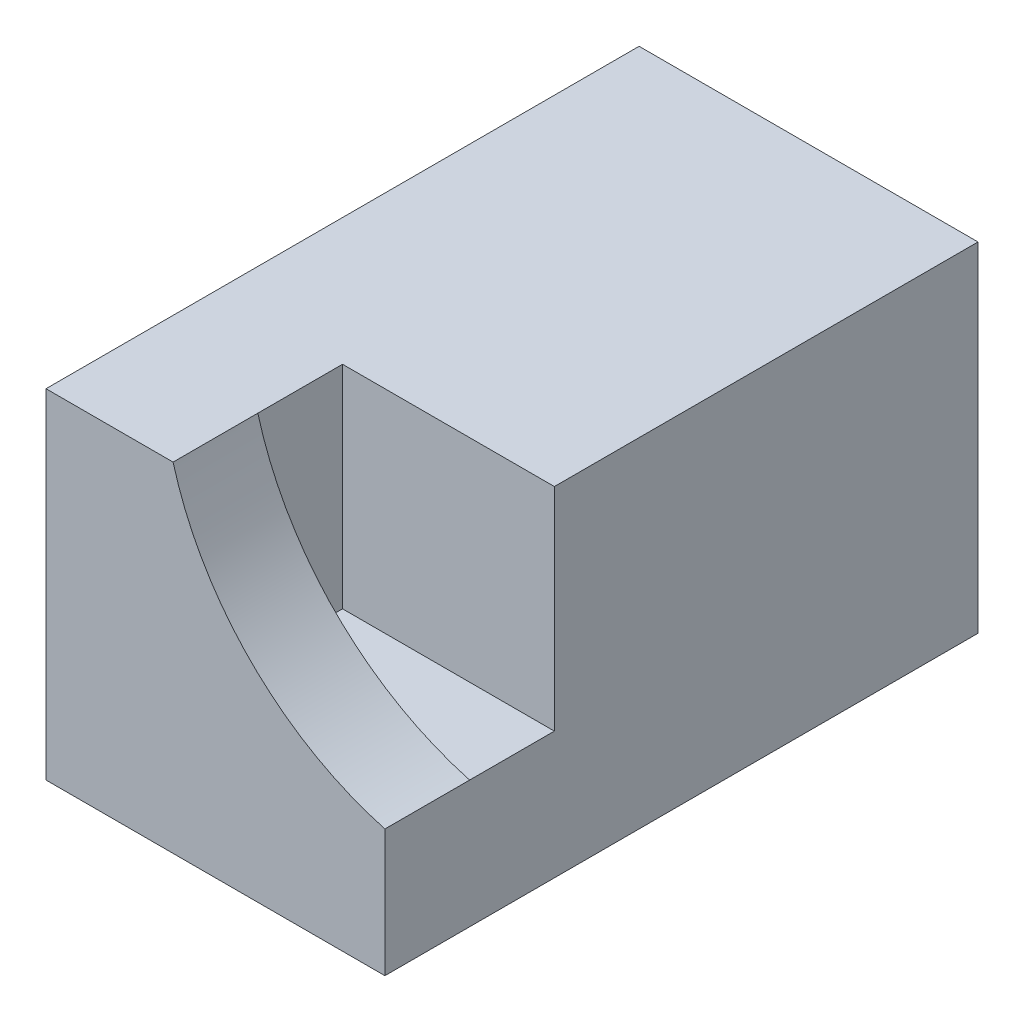
ISO-10303-21;
HEADER;
FILE_DESCRIPTION(('STEP AP214'),'2;1');
FILE_NAME('part.step','',(''),(''),'','','');
FILE_SCHEMA(('AUTOMOTIVE_DESIGN { 1 0 10303 214 1 1 1 1 }'));
ENDSEC;
DATA;
#1=APPLICATION_CONTEXT('core data for automotive mechanical design processes');
#2=APPLICATION_PROTOCOL_DEFINITION('international standard','automotive_design',2000,#1);
#3=PRODUCT_CONTEXT('',#1,'mechanical');
#4=PRODUCT('Part','Part','',(#3));
#5=PRODUCT_RELATED_PRODUCT_CATEGORY('part','',(#4));
#6=PRODUCT_DEFINITION_FORMATION('','',#4);
#7=PRODUCT_DEFINITION_CONTEXT('part definition',#1,'design');
#8=PRODUCT_DEFINITION('design','',#6,#7);
#9=PRODUCT_DEFINITION_SHAPE('','',#8);
#10=(LENGTH_UNIT() NAMED_UNIT(*) SI_UNIT(.MILLI.,.METRE.));
#11=(NAMED_UNIT(*) PLANE_ANGLE_UNIT() SI_UNIT($,.RADIAN.));
#12=(NAMED_UNIT(*) SI_UNIT($,.STERADIAN.) SOLID_ANGLE_UNIT());
#13=UNCERTAINTY_MEASURE_WITH_UNIT(LENGTH_MEASURE(1.E-05),#10,'distance_accuracy_value','');
#14=(GEOMETRIC_REPRESENTATION_CONTEXT(3) GLOBAL_UNCERTAINTY_ASSIGNED_CONTEXT((#13)) GLOBAL_UNIT_ASSIGNED_CONTEXT((#10,
#11,#12)) REPRESENTATION_CONTEXT('',''));
#15=CARTESIAN_POINT('',(0.,0.,0.));
#16=DIRECTION('',(0.,0.,1.));
#17=DIRECTION('',(1.,0.,0.));
#18=AXIS2_PLACEMENT_3D('',#15,#16,#17);
#19=CARTESIAN_POINT('',(0.,0.,14.));
#20=DIRECTION('',(1.,0.,0.));
#21=DIRECTION('',(0.,0.,-1.));
#22=AXIS2_PLACEMENT_3D('',#19,#20,#21);
#23=PLANE('',#22);
#24=DIRECTION('',(0.,-1.,0.));
#25=VECTOR('',#24,1.);
#26=CARTESIAN_POINT('',(0.,0.,0.));
#27=LINE('',#26,#25);
#28=CARTESIAN_POINT('',(0.,8.,0.));
#29=VERTEX_POINT('',#28);
#30=CARTESIAN_POINT('',(0.,0.,0.));
#31=VERTEX_POINT('',#30);
#32=EDGE_CURVE('E151',#29,#31,#27,.T.);
#33=ORIENTED_EDGE('',*,*,#32,.T.);
#34=DIRECTION('',(0.,0.,-1.));
#35=VECTOR('',#34,1.);
#36=CARTESIAN_POINT('',(0.,0.,14.));
#37=LINE('',#36,#35);
#38=CARTESIAN_POINT('',(0.,0.,14.));
#39=VERTEX_POINT('',#38);
#40=EDGE_CURVE('E44',#39,#31,#37,.T.);
#41=ORIENTED_EDGE('',*,*,#40,.F.);
#42=DIRECTION('',(0.,-1.,0.));
#43=VECTOR('',#42,1.);
#44=CARTESIAN_POINT('',(0.,0.,14.));
#45=LINE('',#44,#43);
#46=CARTESIAN_POINT('',(0.,8.,14.));
#47=VERTEX_POINT('',#46);
#48=EDGE_CURVE('E154',#47,#39,#45,.T.);
#49=ORIENTED_EDGE('',*,*,#48,.F.);
#50=DIRECTION('',(0.,0.,-1.));
#51=VECTOR('',#50,1.);
#52=CARTESIAN_POINT('',(0.,8.,14.));
#53=LINE('',#52,#51);
#54=EDGE_CURVE('E161',#47,#29,#53,.T.);
#55=ORIENTED_EDGE('',*,*,#54,.T.);
#56=EDGE_LOOP('',(#33,#41,#49,#55));
#57=FACE_BOUND('',#56,.T.);
#58=ADVANCED_FACE('F37',(#57),#23,.F.);
#59=CARTESIAN_POINT('',(0.,0.,14.));
#60=DIRECTION('',(0.,1.,0.));
#61=DIRECTION('',(0.,0.,1.));
#62=AXIS2_PLACEMENT_3D('',#59,#60,#61);
#63=PLANE('',#62);
#64=DIRECTION('',(1.,0.,0.));
#65=VECTOR('',#64,1.);
#66=CARTESIAN_POINT('',(0.,0.,0.));
#67=LINE('',#66,#65);
#68=CARTESIAN_POINT('',(8.,0.,0.));
#69=VERTEX_POINT('',#68);
#70=EDGE_CURVE('E164',#31,#69,#67,.T.);
#71=ORIENTED_EDGE('',*,*,#70,.T.);
#72=DIRECTION('',(0.,0.,-1.));
#73=VECTOR('',#72,1.);
#74=CARTESIAN_POINT('',(8.,0.,14.));
#75=LINE('',#74,#73);
#76=CARTESIAN_POINT('',(8.,0.,14.));
#77=VERTEX_POINT('',#76);
#78=EDGE_CURVE('E173',#77,#69,#75,.T.);
#79=ORIENTED_EDGE('',*,*,#78,.F.);
#80=DIRECTION('',(1.,0.,0.));
#81=VECTOR('',#80,1.);
#82=CARTESIAN_POINT('',(0.,0.,14.));
#83=LINE('',#82,#81);
#84=EDGE_CURVE('E84',#39,#77,#83,.T.);
#85=ORIENTED_EDGE('',*,*,#84,.F.);
#86=ORIENTED_EDGE('',*,*,#40,.T.);
#87=EDGE_LOOP('',(#71,#79,#85,#86));
#88=FACE_BOUND('',#87,.T.);
#89=ADVANCED_FACE('F176',(#88),#63,.F.);
#90=CARTESIAN_POINT('',(8.,0.,14.));
#91=DIRECTION('',(-1.,0.,0.));
#92=DIRECTION('',(0.,0.,1.));
#93=AXIS2_PLACEMENT_3D('',#90,#91,#92);
#94=PLANE('',#93);
#95=DIRECTION('',(0.,1.,0.));
#96=VECTOR('',#95,1.);
#97=CARTESIAN_POINT('',(8.,0.,10.));
#98=LINE('',#97,#96);
#99=CARTESIAN_POINT('',(8.,3.,10.));
#100=VERTEX_POINT('',#99);
#101=CARTESIAN_POINT('',(8.,8.,10.));
#102=VERTEX_POINT('',#101);
#103=EDGE_CURVE('E139',#100,#102,#98,.T.);
#104=ORIENTED_EDGE('',*,*,#103,.F.);
#105=DIRECTION('',(0.,0.,1.));
#106=VECTOR('',#105,1.);
#107=CARTESIAN_POINT('',(8.,3.,10.));
#108=LINE('',#107,#106);
#109=CARTESIAN_POINT('',(8.,3.,12.));
#110=VERTEX_POINT('',#109);
#111=EDGE_CURVE('E142',#100,#110,#108,.T.);
#112=ORIENTED_EDGE('',*,*,#111,.T.);
#113=CARTESIAN_POINT('',(8.,3.,14.));
#114=VERTEX_POINT('',#113);
#115=EDGE_CURVE('E146',#110,#114,#108,.T.);
#116=ORIENTED_EDGE('',*,*,#115,.T.);
#117=DIRECTION('',(0.,1.,0.));
#118=VECTOR('',#117,1.);
#119=CARTESIAN_POINT('',(8.,0.,14.));
#120=LINE('',#119,#118);
#121=EDGE_CURVE('E157',#77,#114,#120,.T.);
#122=ORIENTED_EDGE('',*,*,#121,.F.);
#123=ORIENTED_EDGE('',*,*,#78,.T.);
#124=DIRECTION('',(0.,1.,0.));
#125=VECTOR('',#124,1.);
#126=CARTESIAN_POINT('',(8.,0.,0.));
#127=LINE('',#126,#125);
#128=CARTESIAN_POINT('',(8.,8.,0.));
#129=VERTEX_POINT('',#128);
#130=EDGE_CURVE('E166',#69,#129,#127,.T.);
#131=ORIENTED_EDGE('',*,*,#130,.T.);
#132=DIRECTION('',(0.,0.,-1.));
#133=VECTOR('',#132,1.);
#134=CARTESIAN_POINT('',(8.,8.,14.));
#135=LINE('',#134,#133);
#136=EDGE_CURVE('E171',#102,#129,#135,.T.);
#137=ORIENTED_EDGE('',*,*,#136,.F.);
#138=EDGE_LOOP('',(#104,#112,#116,#122,#123,#131,#137));
#139=FACE_BOUND('',#138,.T.);
#140=ADVANCED_FACE('F186',(#139),#94,.F.);
#141=CARTESIAN_POINT('',(0.,8.,14.));
#142=DIRECTION('',(0.,-1.,0.));
#143=DIRECTION('',(0.,0.,-1.));
#144=AXIS2_PLACEMENT_3D('',#141,#142,#143);
#145=PLANE('',#144);
#146=DIRECTION('',(-1.,0.,0.));
#147=VECTOR('',#146,1.);
#148=CARTESIAN_POINT('',(0.,8.,14.));
#149=LINE('',#148,#147);
#150=CARTESIAN_POINT('',(3.,8.,14.));
#151=VERTEX_POINT('',#150);
#152=EDGE_CURVE('E58',#151,#47,#149,.T.);
#153=ORIENTED_EDGE('',*,*,#152,.F.);
#154=DIRECTION('',(0.,0.,1.));
#155=VECTOR('',#154,1.);
#156=CARTESIAN_POINT('',(3.,8.,10.));
#157=LINE('',#156,#155);
#158=CARTESIAN_POINT('',(3.,8.,12.));
#159=VERTEX_POINT('',#158);
#160=EDGE_CURVE('E50',#159,#151,#157,.T.);
#161=ORIENTED_EDGE('',*,*,#160,.F.);
#162=CARTESIAN_POINT('',(3.,8.,10.));
#163=VERTEX_POINT('',#162);
#164=EDGE_CURVE('E118',#163,#159,#157,.T.);
#165=ORIENTED_EDGE('',*,*,#164,.F.);
#166=DIRECTION('',(-1.,0.,0.));
#167=VECTOR('',#166,1.);
#168=CARTESIAN_POINT('',(0.,8.,10.));
#169=LINE('',#168,#167);
#170=EDGE_CURVE('E136',#102,#163,#169,.T.);
#171=ORIENTED_EDGE('',*,*,#170,.F.);
#172=ORIENTED_EDGE('',*,*,#136,.T.);
#173=DIRECTION('',(-1.,0.,0.));
#174=VECTOR('',#173,1.);
#175=CARTESIAN_POINT('',(0.,8.,0.));
#176=LINE('',#175,#174);
#177=EDGE_CURVE('E78',#129,#29,#176,.T.);
#178=ORIENTED_EDGE('',*,*,#177,.T.);
#179=ORIENTED_EDGE('',*,*,#54,.F.);
#180=EDGE_LOOP('',(#153,#161,#165,#171,#172,#178,#179));
#181=FACE_BOUND('',#180,.T.);
#182=ADVANCED_FACE('F189',(#181),#145,.F.);
#183=CARTESIAN_POINT('',(0.,0.,14.));
#184=DIRECTION('',(0.,0.,-1.));
#185=DIRECTION('',(-1.,0.,0.));
#186=AXIS2_PLACEMENT_3D('',#183,#184,#185);
#187=PLANE('',#186);
#188=ORIENTED_EDGE('',*,*,#121,.T.);
#189=CARTESIAN_POINT('',(9.89778880751547,9.89778880751547,14.));
#190=DIRECTION('',(0.,0.,1.));
#191=DIRECTION('',(1.,0.,0.));
#192=AXIS2_PLACEMENT_3D('',#189,#190,#191);
#193=CIRCLE('',#192,7.15409622461263);
#194=EDGE_CURVE('E134',#151,#114,#193,.T.);
#195=ORIENTED_EDGE('',*,*,#194,.F.);
#196=ORIENTED_EDGE('',*,*,#152,.T.);
#197=ORIENTED_EDGE('',*,*,#48,.T.);
#198=ORIENTED_EDGE('',*,*,#84,.T.);
#199=EDGE_LOOP('',(#188,#195,#196,#197,#198));
#200=FACE_BOUND('',#199,.T.);
#201=ADVANCED_FACE('F188',(#200),#187,.F.);
#202=CARTESIAN_POINT('',(0.,0.,0.));
#203=DIRECTION('',(0.,0.,-1.));
#204=DIRECTION('',(-1.,0.,0.));
#205=AXIS2_PLACEMENT_3D('',#202,#203,#204);
#206=PLANE('',#205);
#207=CARTESIAN_POINT('',(4.,4.,0.));
#208=DIRECTION('',(0.,0.,-1.));
#209=DIRECTION('',(-1.,0.,0.));
#210=AXIS2_PLACEMENT_3D('',#207,#208,#209);
#211=CIRCLE('',#210,1.375);
#212=CARTESIAN_POINT('',(2.625,4.,0.));
#213=VERTEX_POINT('',#212);
#214=EDGE_CURVE('E145',#213,#213,#211,.T.);
#215=ORIENTED_EDGE('',*,*,#214,.F.);
#216=EDGE_LOOP('',(#215));
#217=FACE_BOUND('',#216,.T.);
#218=ORIENTED_EDGE('',*,*,#32,.F.);
#219=ORIENTED_EDGE('',*,*,#177,.F.);
#220=ORIENTED_EDGE('',*,*,#130,.F.);
#221=ORIENTED_EDGE('',*,*,#70,.F.);
#222=EDGE_LOOP('',(#218,#219,#220,#221));
#223=FACE_BOUND('',#222,.T.);
#224=ADVANCED_FACE('F181',(#217,#223),#206,.T.);
#225=CARTESIAN_POINT('',(4.,4.,8.));
#226=DIRECTION('',(0.,0.,-1.));
#227=DIRECTION('',(-1.,0.,0.));
#228=AXIS2_PLACEMENT_3D('',#225,#226,#227);
#229=CYLINDRICAL_SURFACE('',#228,1.375);
#230=CARTESIAN_POINT('',(4.,4.,8.));
#231=DIRECTION('',(0.,0.,-1.));
#232=DIRECTION('',(-1.,0.,0.));
#233=AXIS2_PLACEMENT_3D('',#230,#231,#232);
#234=CIRCLE('',#233,1.375);
#235=CARTESIAN_POINT('',(2.625,4.,8.));
#236=VERTEX_POINT('',#235);
#237=EDGE_CURVE('E148',#236,#236,#234,.T.);
#238=ORIENTED_EDGE('',*,*,#237,.F.);
#239=EDGE_LOOP('',(#238));
#240=FACE_BOUND('',#239,.T.);
#241=ORIENTED_EDGE('',*,*,#214,.T.);
#242=EDGE_LOOP('',(#241));
#243=FACE_BOUND('',#242,.T.);
#244=ADVANCED_FACE('F217',(#240,#243),#229,.F.);
#245=CARTESIAN_POINT('',(4.,4.,8.));
#246=DIRECTION('',(0.,0.,-1.));
#247=DIRECTION('',(-1.,0.,0.));
#248=AXIS2_PLACEMENT_3D('',#245,#246,#247);
#249=PLANE('',#248);
#250=ORIENTED_EDGE('',*,*,#237,.T.);
#251=EDGE_LOOP('',(#250));
#252=FACE_BOUND('',#251,.T.);
#253=ADVANCED_FACE('F201',(#252),#249,.T.);
#254=CARTESIAN_POINT('',(9.89778880751547,9.89778880751547,10.));
#255=DIRECTION('',(0.,0.,1.));
#256=DIRECTION('',(1.,0.,0.));
#257=AXIS2_PLACEMENT_3D('',#254,#255,#256);
#258=CYLINDRICAL_SURFACE('',#257,7.15409622461263);
#259=ORIENTED_EDGE('',*,*,#115,.F.);
#260=CARTESIAN_POINT('',(9.89778880751547,9.89778880751547,12.));
#261=DIRECTION('',(0.,0.,1.));
#262=DIRECTION('',(1.,0.,0.));
#263=AXIS2_PLACEMENT_3D('',#260,#261,#262);
#264=CIRCLE('',#263,7.15409622461263);
#265=EDGE_CURVE('E11',#110,#159,#264,.F.);
#266=ORIENTED_EDGE('',*,*,#265,.T.);
#267=ORIENTED_EDGE('',*,*,#160,.T.);
#268=ORIENTED_EDGE('',*,*,#194,.T.);
#269=EDGE_LOOP('',(#259,#266,#267,#268));
#270=FACE_BOUND('',#269,.T.);
#271=ADVANCED_FACE('F194',(#270),#258,.F.);
#272=CARTESIAN_POINT('',(0.,0.,10.));
#273=DIRECTION('',(0.,0.,1.));
#274=DIRECTION('',(1.,0.,0.));
#275=AXIS2_PLACEMENT_3D('',#272,#273,#274);
#276=PLANE('',#275);
#277=ORIENTED_EDGE('',*,*,#170,.T.);
#278=DIRECTION('',(0.,1.,0.));
#279=VECTOR('',#278,1.);
#280=CARTESIAN_POINT('',(3.,3.,10.));
#281=LINE('',#280,#279);
#282=CARTESIAN_POINT('',(3.,3.,10.));
#283=VERTEX_POINT('',#282);
#284=EDGE_CURVE('E120',#283,#163,#281,.T.);
#285=ORIENTED_EDGE('',*,*,#284,.F.);
#286=DIRECTION('',(-1.,0.,0.));
#287=VECTOR('',#286,1.);
#288=CARTESIAN_POINT('',(3.,3.,10.));
#289=LINE('',#288,#287);
#290=EDGE_CURVE('E121',#100,#283,#289,.T.);
#291=ORIENTED_EDGE('',*,*,#290,.F.);
#292=ORIENTED_EDGE('',*,*,#103,.T.);
#293=EDGE_LOOP('',(#277,#285,#291,#292));
#294=FACE_BOUND('',#293,.T.);
#295=ADVANCED_FACE('F192',(#294),#276,.T.);
#296=CARTESIAN_POINT('',(3.,3.,12.));
#297=DIRECTION('',(0.,0.,1.));
#298=DIRECTION('',(1.,0.,0.));
#299=AXIS2_PLACEMENT_3D('',#296,#297,#298);
#300=PLANE('',#299);
#301=DIRECTION('',(1.,0.,0.));
#302=VECTOR('',#301,1.);
#303=CARTESIAN_POINT('',(3.,3.,12.));
#304=LINE('',#303,#302);
#305=CARTESIAN_POINT('',(3.,3.,12.));
#306=VERTEX_POINT('',#305);
#307=EDGE_CURVE('E124',#306,#110,#304,.T.);
#308=ORIENTED_EDGE('',*,*,#307,.F.);
#309=DIRECTION('',(0.,1.,0.));
#310=VECTOR('',#309,1.);
#311=CARTESIAN_POINT('',(3.,3.,12.));
#312=LINE('',#311,#310);
#313=EDGE_CURVE('E111',#306,#159,#312,.T.);
#314=ORIENTED_EDGE('',*,*,#313,.T.);
#315=ORIENTED_EDGE('',*,*,#265,.F.);
#316=EDGE_LOOP('',(#308,#314,#315));
#317=FACE_BOUND('',#316,.T.);
#318=ADVANCED_FACE('F125',(#317),#300,.F.);
#319=CARTESIAN_POINT('',(3.,3.,10.));
#320=DIRECTION('',(-1.,0.,0.));
#321=DIRECTION('',(0.,0.,1.));
#322=AXIS2_PLACEMENT_3D('',#319,#320,#321);
#323=PLANE('',#322);
#324=ORIENTED_EDGE('',*,*,#164,.T.);
#325=ORIENTED_EDGE('',*,*,#313,.F.);
#326=DIRECTION('',(0.,0.,1.));
#327=VECTOR('',#326,1.);
#328=CARTESIAN_POINT('',(3.,3.,10.));
#329=LINE('',#328,#327);
#330=EDGE_CURVE('E115',#283,#306,#329,.T.);
#331=ORIENTED_EDGE('',*,*,#330,.F.);
#332=ORIENTED_EDGE('',*,*,#284,.T.);
#333=EDGE_LOOP('',(#324,#325,#331,#332));
#334=FACE_BOUND('',#333,.T.);
#335=ADVANCED_FACE('F113',(#334),#323,.F.);
#336=CARTESIAN_POINT('',(0.,3.,0.));
#337=DIRECTION('',(0.,1.,0.));
#338=DIRECTION('',(0.,0.,1.));
#339=AXIS2_PLACEMENT_3D('',#336,#337,#338);
#340=PLANE('',#339);
#341=ORIENTED_EDGE('',*,*,#330,.T.);
#342=ORIENTED_EDGE('',*,*,#307,.T.);
#343=ORIENTED_EDGE('',*,*,#111,.F.);
#344=ORIENTED_EDGE('',*,*,#290,.T.);
#345=EDGE_LOOP('',(#341,#342,#343,#344));
#346=FACE_BOUND('',#345,.T.);
#347=ADVANCED_FACE('F129',(#346),#340,.T.);
#348=CLOSED_SHELL('',(#58,#89,#140,#182,#201,#224,#244,#253,#271,#295,#318,#335,#347));
#349=MANIFOLD_SOLID_BREP('B2',#348);
#350=ADVANCED_BREP_SHAPE_REPRESENTATION('',(#18,#349),#14);
#351=SHAPE_DEFINITION_REPRESENTATION(#9,#350);
ENDSEC;
END-ISO-10303-21;
